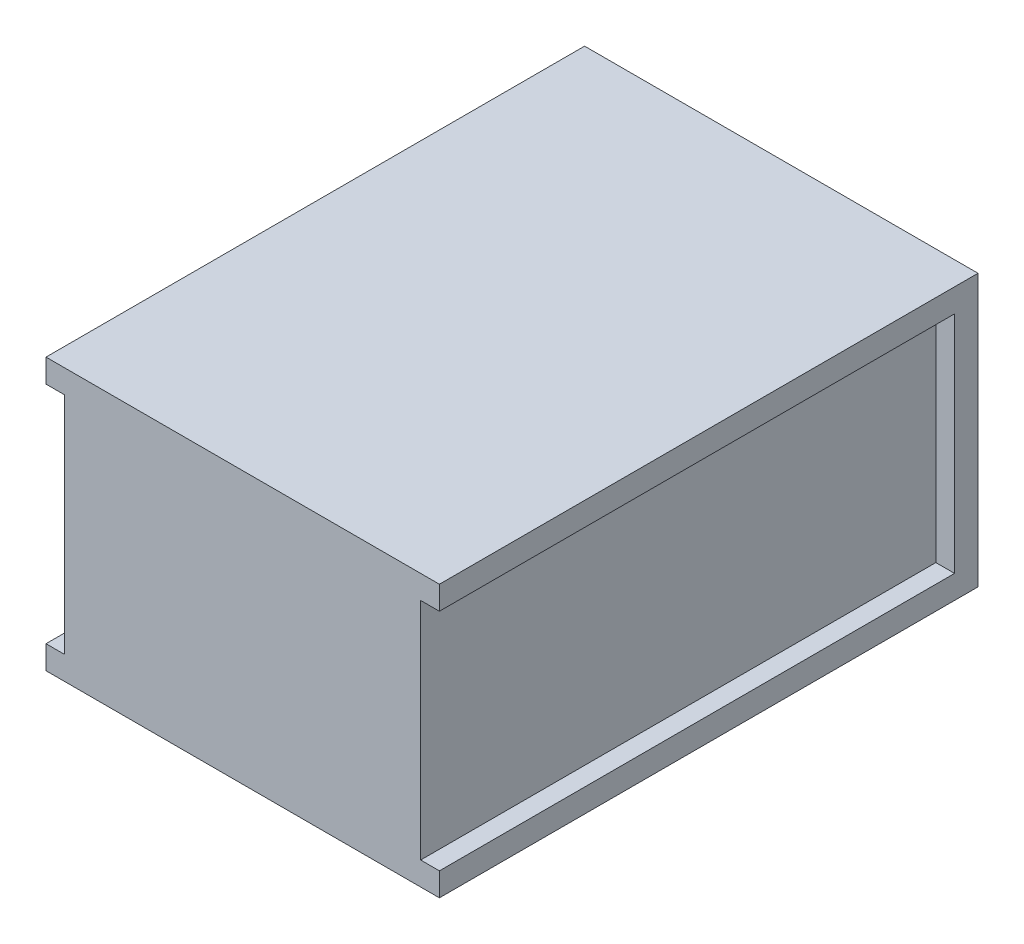
ISO-10303-21;
HEADER;
FILE_DESCRIPTION(('STEP AP214'),'2;1');
FILE_NAME('part.step','',(''),(''),'','','');
FILE_SCHEMA(('AUTOMOTIVE_DESIGN { 1 0 10303 214 1 1 1 1 }'));
ENDSEC;
DATA;
#1=APPLICATION_CONTEXT('core data for automotive mechanical design processes');
#2=APPLICATION_PROTOCOL_DEFINITION('international standard','automotive_design',2000,#1);
#3=PRODUCT_CONTEXT('',#1,'mechanical');
#4=PRODUCT('Part','Part','',(#3));
#5=PRODUCT_RELATED_PRODUCT_CATEGORY('part','',(#4));
#6=PRODUCT_DEFINITION_FORMATION('','',#4);
#7=PRODUCT_DEFINITION_CONTEXT('part definition',#1,'design');
#8=PRODUCT_DEFINITION('design','',#6,#7);
#9=PRODUCT_DEFINITION_SHAPE('','',#8);
#10=(LENGTH_UNIT() NAMED_UNIT(*) SI_UNIT(.MILLI.,.METRE.));
#11=(NAMED_UNIT(*) PLANE_ANGLE_UNIT() SI_UNIT($,.RADIAN.));
#12=(NAMED_UNIT(*) SI_UNIT($,.STERADIAN.) SOLID_ANGLE_UNIT());
#13=UNCERTAINTY_MEASURE_WITH_UNIT(LENGTH_MEASURE(1.E-05),#10,'distance_accuracy_value','');
#14=(GEOMETRIC_REPRESENTATION_CONTEXT(3) GLOBAL_UNCERTAINTY_ASSIGNED_CONTEXT((#13)) GLOBAL_UNIT_ASSIGNED_CONTEXT((#10,
#11,#12)) REPRESENTATION_CONTEXT('',''));
#15=CARTESIAN_POINT('',(0.,0.,0.));
#16=DIRECTION('',(0.,0.,1.));
#17=DIRECTION('',(1.,0.,0.));
#18=AXIS2_PLACEMENT_3D('',#15,#16,#17);
#19=CARTESIAN_POINT('',(-42.,58.,57.5));
#20=DIRECTION('',(0.,0.,-1.));
#21=DIRECTION('',(-1.,0.,0.));
#22=AXIS2_PLACEMENT_3D('',#19,#20,#21);
#23=PLANE('',#22);
#24=DIRECTION('',(1.,0.,0.));
#25=VECTOR('',#24,1.);
#26=CARTESIAN_POINT('',(38.,53.,57.5));
#27=LINE('',#26,#25);
#28=CARTESIAN_POINT('',(38.,53.,57.5));
#29=VERTEX_POINT('',#28);
#30=CARTESIAN_POINT('',(42.,53.,57.5));
#31=VERTEX_POINT('',#30);
#32=EDGE_CURVE('E167',#29,#31,#27,.T.);
#33=ORIENTED_EDGE('',*,*,#32,.T.);
#34=DIRECTION('',(0.,-1.,0.));
#35=VECTOR('',#34,1.);
#36=CARTESIAN_POINT('',(42.,58.,57.5));
#37=LINE('',#36,#35);
#38=CARTESIAN_POINT('',(42.,58.,57.5));
#39=VERTEX_POINT('',#38);
#40=EDGE_CURVE('E202',#39,#31,#37,.T.);
#41=ORIENTED_EDGE('',*,*,#40,.F.);
#42=DIRECTION('',(1.,0.,0.));
#43=VECTOR('',#42,1.);
#44=CARTESIAN_POINT('',(-42.,58.,57.5));
#45=LINE('',#44,#43);
#46=CARTESIAN_POINT('',(-42.,58.,57.5));
#47=VERTEX_POINT('',#46);
#48=EDGE_CURVE('E183',#47,#39,#45,.T.);
#49=ORIENTED_EDGE('',*,*,#48,.F.);
#50=DIRECTION('',(0.,-1.,0.));
#51=VECTOR('',#50,1.);
#52=CARTESIAN_POINT('',(-42.,58.,57.5));
#53=LINE('',#52,#51);
#54=CARTESIAN_POINT('',(-42.,53.,57.5));
#55=VERTEX_POINT('',#54);
#56=EDGE_CURVE('E11',#47,#55,#53,.T.);
#57=ORIENTED_EDGE('',*,*,#56,.T.);
#58=DIRECTION('',(-1.,0.,0.));
#59=VECTOR('',#58,1.);
#60=CARTESIAN_POINT('',(-38.,53.,57.5));
#61=LINE('',#60,#59);
#62=CARTESIAN_POINT('',(-38.,53.,57.5));
#63=VERTEX_POINT('',#62);
#64=EDGE_CURVE('E162',#63,#55,#61,.T.);
#65=ORIENTED_EDGE('',*,*,#64,.F.);
#66=DIRECTION('',(0.,1.,0.));
#67=VECTOR('',#66,1.);
#68=CARTESIAN_POINT('',(-38.,53.,57.5));
#69=LINE('',#68,#67);
#70=CARTESIAN_POINT('',(-38.,4.99999999999999,57.5));
#71=VERTEX_POINT('',#70);
#72=EDGE_CURVE('E153',#71,#63,#69,.T.);
#73=ORIENTED_EDGE('',*,*,#72,.F.);
#74=DIRECTION('',(-1.,0.,0.));
#75=VECTOR('',#74,1.);
#76=CARTESIAN_POINT('',(-38.,5.,57.5));
#77=LINE('',#76,#75);
#78=CARTESIAN_POINT('',(-42.,5.,57.5));
#79=VERTEX_POINT('',#78);
#80=EDGE_CURVE('E171',#71,#79,#77,.T.);
#81=ORIENTED_EDGE('',*,*,#80,.T.);
#82=CARTESIAN_POINT('',(-42.,0.,57.5));
#83=VERTEX_POINT('',#82);
#84=EDGE_CURVE('E44',#79,#83,#53,.T.);
#85=ORIENTED_EDGE('',*,*,#84,.T.);
#86=DIRECTION('',(1.,0.,0.));
#87=VECTOR('',#86,1.);
#88=CARTESIAN_POINT('',(-42.,0.,57.5));
#89=LINE('',#88,#87);
#90=CARTESIAN_POINT('',(42.,0.,57.5));
#91=VERTEX_POINT('',#90);
#92=EDGE_CURVE('E193',#83,#91,#89,.T.);
#93=ORIENTED_EDGE('',*,*,#92,.T.);
#94=CARTESIAN_POINT('',(42.,5.00000000000001,57.5));
#95=VERTEX_POINT('',#94);
#96=EDGE_CURVE('E146',#95,#91,#37,.T.);
#97=ORIENTED_EDGE('',*,*,#96,.F.);
#98=DIRECTION('',(1.,0.,0.));
#99=VECTOR('',#98,1.);
#100=CARTESIAN_POINT('',(38.,5.,57.5));
#101=LINE('',#100,#99);
#102=CARTESIAN_POINT('',(38.,5.,57.5));
#103=VERTEX_POINT('',#102);
#104=EDGE_CURVE('E51',#103,#95,#101,.T.);
#105=ORIENTED_EDGE('',*,*,#104,.F.);
#106=DIRECTION('',(0.,1.,0.));
#107=VECTOR('',#106,1.);
#108=CARTESIAN_POINT('',(38.,53.,57.5));
#109=LINE('',#108,#107);
#110=EDGE_CURVE('E134',#103,#29,#109,.T.);
#111=ORIENTED_EDGE('',*,*,#110,.T.);
#112=EDGE_LOOP('',(#33,#41,#49,#57,#65,#73,#81,#85,#93,#97,#105,#111));
#113=FACE_BOUND('',#112,.T.);
#114=ADVANCED_FACE('F36',(#113),#23,.F.);
#115=CARTESIAN_POINT('',(42.,58.,-57.5));
#116=DIRECTION('',(-1.,0.,0.));
#117=DIRECTION('',(0.,0.,1.));
#118=AXIS2_PLACEMENT_3D('',#115,#116,#117);
#119=PLANE('',#118);
#120=DIRECTION('',(0.,0.,-1.));
#121=VECTOR('',#120,1.);
#122=CARTESIAN_POINT('',(42.,53.,57.5));
#123=LINE('',#122,#121);
#124=CARTESIAN_POINT('',(42.,53.,-52.5));
#125=VERTEX_POINT('',#124);
#126=EDGE_CURVE('E142',#31,#125,#123,.T.);
#127=ORIENTED_EDGE('',*,*,#126,.T.);
#128=DIRECTION('',(0.,-1.,0.));
#129=VECTOR('',#128,1.);
#130=CARTESIAN_POINT('',(42.,53.,-52.5));
#131=LINE('',#130,#129);
#132=CARTESIAN_POINT('',(42.,4.99999999999999,-52.5));
#133=VERTEX_POINT('',#132);
#134=EDGE_CURVE('E233',#125,#133,#131,.T.);
#135=ORIENTED_EDGE('',*,*,#134,.T.);
#136=DIRECTION('',(0.,0.,1.));
#137=VECTOR('',#136,1.);
#138=CARTESIAN_POINT('',(42.,5.,57.5));
#139=LINE('',#138,#137);
#140=EDGE_CURVE('E212',#133,#95,#139,.T.);
#141=ORIENTED_EDGE('',*,*,#140,.T.);
#142=ORIENTED_EDGE('',*,*,#96,.T.);
#143=DIRECTION('',(0.,0.,-1.));
#144=VECTOR('',#143,1.);
#145=CARTESIAN_POINT('',(42.,0.,-57.5));
#146=LINE('',#145,#144);
#147=CARTESIAN_POINT('',(42.,0.,-57.5));
#148=VERTEX_POINT('',#147);
#149=EDGE_CURVE('E195',#91,#148,#146,.T.);
#150=ORIENTED_EDGE('',*,*,#149,.T.);
#151=DIRECTION('',(0.,-1.,0.));
#152=VECTOR('',#151,1.);
#153=CARTESIAN_POINT('',(42.,58.,-57.5));
#154=LINE('',#153,#152);
#155=CARTESIAN_POINT('',(42.,58.,-57.5));
#156=VERTEX_POINT('',#155);
#157=EDGE_CURVE('E200',#156,#148,#154,.T.);
#158=ORIENTED_EDGE('',*,*,#157,.F.);
#159=DIRECTION('',(0.,0.,-1.));
#160=VECTOR('',#159,1.);
#161=CARTESIAN_POINT('',(42.,58.,-57.5));
#162=LINE('',#161,#160);
#163=EDGE_CURVE('E186',#39,#156,#162,.T.);
#164=ORIENTED_EDGE('',*,*,#163,.F.);
#165=ORIENTED_EDGE('',*,*,#40,.T.);
#166=EDGE_LOOP('',(#127,#135,#141,#142,#150,#158,#164,#165));
#167=FACE_BOUND('',#166,.T.);
#168=ADVANCED_FACE('F208',(#167),#119,.F.);
#169=CARTESIAN_POINT('',(-42.,58.,-57.5));
#170=DIRECTION('',(1.,0.,0.));
#171=DIRECTION('',(0.,0.,-1.));
#172=AXIS2_PLACEMENT_3D('',#169,#170,#171);
#173=PLANE('',#172);
#174=ORIENTED_EDGE('',*,*,#84,.F.);
#175=DIRECTION('',(0.,0.,1.));
#176=VECTOR('',#175,1.);
#177=CARTESIAN_POINT('',(-42.,5.,57.5));
#178=LINE('',#177,#176);
#179=CARTESIAN_POINT('',(-42.,4.99999999999999,-52.5));
#180=VERTEX_POINT('',#179);
#181=EDGE_CURVE('E156',#180,#79,#178,.T.);
#182=ORIENTED_EDGE('',*,*,#181,.F.);
#183=DIRECTION('',(0.,-1.,0.));
#184=VECTOR('',#183,1.);
#185=CARTESIAN_POINT('',(-42.,53.,-52.5));
#186=LINE('',#185,#184);
#187=CARTESIAN_POINT('',(-42.,53.,-52.5));
#188=VERTEX_POINT('',#187);
#189=EDGE_CURVE('E166',#188,#180,#186,.T.);
#190=ORIENTED_EDGE('',*,*,#189,.F.);
#191=DIRECTION('',(0.,0.,-1.));
#192=VECTOR('',#191,1.);
#193=CARTESIAN_POINT('',(-42.,53.,57.5));
#194=LINE('',#193,#192);
#195=EDGE_CURVE('E163',#55,#188,#194,.T.);
#196=ORIENTED_EDGE('',*,*,#195,.F.);
#197=ORIENTED_EDGE('',*,*,#56,.F.);
#198=DIRECTION('',(0.,0.,1.));
#199=VECTOR('',#198,1.);
#200=CARTESIAN_POINT('',(-42.,58.,-57.5));
#201=LINE('',#200,#199);
#202=CARTESIAN_POINT('',(-42.,58.,-57.5));
#203=VERTEX_POINT('',#202);
#204=EDGE_CURVE('E180',#203,#47,#201,.T.);
#205=ORIENTED_EDGE('',*,*,#204,.F.);
#206=DIRECTION('',(0.,-1.,0.));
#207=VECTOR('',#206,1.);
#208=CARTESIAN_POINT('',(-42.,58.,-57.5));
#209=LINE('',#208,#207);
#210=CARTESIAN_POINT('',(-42.,0.,-57.5));
#211=VERTEX_POINT('',#210);
#212=EDGE_CURVE('E190',#203,#211,#209,.T.);
#213=ORIENTED_EDGE('',*,*,#212,.T.);
#214=DIRECTION('',(0.,0.,1.));
#215=VECTOR('',#214,1.);
#216=CARTESIAN_POINT('',(-42.,0.,-57.5));
#217=LINE('',#216,#215);
#218=EDGE_CURVE('E174',#211,#83,#217,.T.);
#219=ORIENTED_EDGE('',*,*,#218,.T.);
#220=EDGE_LOOP('',(#174,#182,#190,#196,#197,#205,#213,#219));
#221=FACE_BOUND('',#220,.T.);
#222=ADVANCED_FACE('F38',(#221),#173,.F.);
#223=CARTESIAN_POINT('',(-42.,58.,-57.5));
#224=DIRECTION('',(0.,0.,1.));
#225=DIRECTION('',(1.,0.,0.));
#226=AXIS2_PLACEMENT_3D('',#223,#224,#225);
#227=PLANE('',#226);
#228=DIRECTION('',(-1.,0.,0.));
#229=VECTOR('',#228,1.);
#230=CARTESIAN_POINT('',(-42.,0.,-57.5));
#231=LINE('',#230,#229);
#232=EDGE_CURVE('E184',#148,#211,#231,.T.);
#233=ORIENTED_EDGE('',*,*,#232,.T.);
#234=ORIENTED_EDGE('',*,*,#212,.F.);
#235=DIRECTION('',(-1.,0.,0.));
#236=VECTOR('',#235,1.);
#237=CARTESIAN_POINT('',(-42.,58.,-57.5));
#238=LINE('',#237,#236);
#239=EDGE_CURVE('E188',#156,#203,#238,.T.);
#240=ORIENTED_EDGE('',*,*,#239,.F.);
#241=ORIENTED_EDGE('',*,*,#157,.T.);
#242=EDGE_LOOP('',(#233,#234,#240,#241));
#243=FACE_BOUND('',#242,.T.);
#244=ADVANCED_FACE('F221',(#243),#227,.F.);
#245=CARTESIAN_POINT('',(0.,58.,0.));
#246=DIRECTION('',(0.,1.,0.));
#247=DIRECTION('',(0.,0.,1.));
#248=AXIS2_PLACEMENT_3D('',#245,#246,#247);
#249=PLANE('',#248);
#250=ORIENTED_EDGE('',*,*,#204,.T.);
#251=ORIENTED_EDGE('',*,*,#48,.T.);
#252=ORIENTED_EDGE('',*,*,#163,.T.);
#253=ORIENTED_EDGE('',*,*,#239,.T.);
#254=EDGE_LOOP('',(#250,#251,#252,#253));
#255=FACE_BOUND('',#254,.T.);
#256=ADVANCED_FACE('F228',(#255),#249,.T.);
#257=CARTESIAN_POINT('',(0.,0.,0.));
#258=DIRECTION('',(0.,1.,0.));
#259=DIRECTION('',(0.,0.,1.));
#260=AXIS2_PLACEMENT_3D('',#257,#258,#259);
#261=PLANE('',#260);
#262=ORIENTED_EDGE('',*,*,#218,.F.);
#263=ORIENTED_EDGE('',*,*,#232,.F.);
#264=ORIENTED_EDGE('',*,*,#149,.F.);
#265=ORIENTED_EDGE('',*,*,#92,.F.);
#266=EDGE_LOOP('',(#262,#263,#264,#265));
#267=FACE_BOUND('',#266,.T.);
#268=ADVANCED_FACE('F218',(#267),#261,.F.);
#269=CARTESIAN_POINT('',(-38.,5.,57.5));
#270=DIRECTION('',(0.,-1.,0.));
#271=DIRECTION('',(0.,0.,-1.));
#272=AXIS2_PLACEMENT_3D('',#269,#270,#271);
#273=PLANE('',#272);
#274=ORIENTED_EDGE('',*,*,#181,.T.);
#275=ORIENTED_EDGE('',*,*,#80,.F.);
#276=DIRECTION('',(0.,0.,1.));
#277=VECTOR('',#276,1.);
#278=CARTESIAN_POINT('',(-38.,5.,57.5));
#279=LINE('',#278,#277);
#280=CARTESIAN_POINT('',(-38.,4.99999999999999,-52.5));
#281=VERTEX_POINT('',#280);
#282=EDGE_CURVE('E59',#281,#71,#279,.T.);
#283=ORIENTED_EDGE('',*,*,#282,.F.);
#284=DIRECTION('',(-1.,0.,0.));
#285=VECTOR('',#284,1.);
#286=CARTESIAN_POINT('',(-38.,4.99999999999999,-52.5));
#287=LINE('',#286,#285);
#288=EDGE_CURVE('E175',#281,#180,#287,.T.);
#289=ORIENTED_EDGE('',*,*,#288,.T.);
#290=EDGE_LOOP('',(#274,#275,#283,#289));
#291=FACE_BOUND('',#290,.T.);
#292=ADVANCED_FACE('F262',(#291),#273,.F.);
#293=CARTESIAN_POINT('',(-38.,53.,-52.5));
#294=DIRECTION('',(0.,0.,-1.));
#295=DIRECTION('',(0.,1.,0.));
#296=AXIS2_PLACEMENT_3D('',#293,#294,#295);
#297=PLANE('',#296);
#298=ORIENTED_EDGE('',*,*,#189,.T.);
#299=ORIENTED_EDGE('',*,*,#288,.F.);
#300=DIRECTION('',(0.,-1.,0.));
#301=VECTOR('',#300,1.);
#302=CARTESIAN_POINT('',(-38.,53.,-52.5));
#303=LINE('',#302,#301);
#304=CARTESIAN_POINT('',(-38.,53.,-52.5));
#305=VERTEX_POINT('',#304);
#306=EDGE_CURVE('E159',#305,#281,#303,.T.);
#307=ORIENTED_EDGE('',*,*,#306,.F.);
#308=DIRECTION('',(-1.,0.,0.));
#309=VECTOR('',#308,1.);
#310=CARTESIAN_POINT('',(-38.,53.,-52.5));
#311=LINE('',#310,#309);
#312=EDGE_CURVE('E177',#305,#188,#311,.T.);
#313=ORIENTED_EDGE('',*,*,#312,.T.);
#314=EDGE_LOOP('',(#298,#299,#307,#313));
#315=FACE_BOUND('',#314,.T.);
#316=ADVANCED_FACE('F267',(#315),#297,.F.);
#317=CARTESIAN_POINT('',(-38.,53.,57.5));
#318=DIRECTION('',(0.,1.,0.));
#319=DIRECTION('',(0.,0.,1.));
#320=AXIS2_PLACEMENT_3D('',#317,#318,#319);
#321=PLANE('',#320);
#322=ORIENTED_EDGE('',*,*,#195,.T.);
#323=ORIENTED_EDGE('',*,*,#312,.F.);
#324=DIRECTION('',(0.,0.,-1.));
#325=VECTOR('',#324,1.);
#326=CARTESIAN_POINT('',(-38.,53.,57.5));
#327=LINE('',#326,#325);
#328=EDGE_CURVE('E155',#63,#305,#327,.T.);
#329=ORIENTED_EDGE('',*,*,#328,.F.);
#330=ORIENTED_EDGE('',*,*,#64,.T.);
#331=EDGE_LOOP('',(#322,#323,#329,#330));
#332=FACE_BOUND('',#331,.T.);
#333=ADVANCED_FACE('F249',(#332),#321,.F.);
#334=CARTESIAN_POINT('',(-38.,0.,0.));
#335=DIRECTION('',(1.,0.,0.));
#336=DIRECTION('',(0.,0.,-1.));
#337=AXIS2_PLACEMENT_3D('',#334,#335,#336);
#338=PLANE('',#337);
#339=ORIENTED_EDGE('',*,*,#72,.T.);
#340=ORIENTED_EDGE('',*,*,#328,.T.);
#341=ORIENTED_EDGE('',*,*,#306,.T.);
#342=ORIENTED_EDGE('',*,*,#282,.T.);
#343=EDGE_LOOP('',(#339,#340,#341,#342));
#344=FACE_BOUND('',#343,.T.);
#345=ADVANCED_FACE('F242',(#344),#338,.F.);
#346=CARTESIAN_POINT('',(38.,53.,57.5));
#347=DIRECTION('',(0.,-1.,0.));
#348=DIRECTION('',(0.,0.,-1.));
#349=AXIS2_PLACEMENT_3D('',#346,#347,#348);
#350=PLANE('',#349);
#351=ORIENTED_EDGE('',*,*,#126,.F.);
#352=ORIENTED_EDGE('',*,*,#32,.F.);
#353=DIRECTION('',(0.,0.,-1.));
#354=VECTOR('',#353,1.);
#355=CARTESIAN_POINT('',(38.,53.,57.5));
#356=LINE('',#355,#354);
#357=CARTESIAN_POINT('',(38.,53.,-52.5));
#358=VERTEX_POINT('',#357);
#359=EDGE_CURVE('E138',#29,#358,#356,.T.);
#360=ORIENTED_EDGE('',*,*,#359,.T.);
#361=DIRECTION('',(1.,0.,0.));
#362=VECTOR('',#361,1.);
#363=CARTESIAN_POINT('',(38.,53.,-52.5));
#364=LINE('',#363,#362);
#365=EDGE_CURVE('E148',#358,#125,#364,.T.);
#366=ORIENTED_EDGE('',*,*,#365,.T.);
#367=EDGE_LOOP('',(#351,#352,#360,#366));
#368=FACE_BOUND('',#367,.T.);
#369=ADVANCED_FACE('F240',(#368),#350,.T.);
#370=CARTESIAN_POINT('',(38.,53.,-52.5));
#371=DIRECTION('',(0.,0.,1.));
#372=DIRECTION('',(0.,-1.,0.));
#373=AXIS2_PLACEMENT_3D('',#370,#371,#372);
#374=PLANE('',#373);
#375=ORIENTED_EDGE('',*,*,#134,.F.);
#376=ORIENTED_EDGE('',*,*,#365,.F.);
#377=DIRECTION('',(0.,-1.,0.));
#378=VECTOR('',#377,1.);
#379=CARTESIAN_POINT('',(38.,53.,-52.5));
#380=LINE('',#379,#378);
#381=CARTESIAN_POINT('',(38.,4.99999999999999,-52.5));
#382=VERTEX_POINT('',#381);
#383=EDGE_CURVE('E133',#358,#382,#380,.T.);
#384=ORIENTED_EDGE('',*,*,#383,.T.);
#385=DIRECTION('',(1.,0.,0.));
#386=VECTOR('',#385,1.);
#387=CARTESIAN_POINT('',(38.,4.99999999999999,-52.5));
#388=LINE('',#387,#386);
#389=EDGE_CURVE('E130',#382,#133,#388,.T.);
#390=ORIENTED_EDGE('',*,*,#389,.T.);
#391=EDGE_LOOP('',(#375,#376,#384,#390));
#392=FACE_BOUND('',#391,.T.);
#393=ADVANCED_FACE('F239',(#392),#374,.T.);
#394=CARTESIAN_POINT('',(38.,5.,57.5));
#395=DIRECTION('',(0.,1.,0.));
#396=DIRECTION('',(0.,0.,1.));
#397=AXIS2_PLACEMENT_3D('',#394,#395,#396);
#398=PLANE('',#397);
#399=ORIENTED_EDGE('',*,*,#140,.F.);
#400=ORIENTED_EDGE('',*,*,#389,.F.);
#401=DIRECTION('',(0.,0.,1.));
#402=VECTOR('',#401,1.);
#403=CARTESIAN_POINT('',(38.,5.,57.5));
#404=LINE('',#403,#402);
#405=EDGE_CURVE('E127',#382,#103,#404,.T.);
#406=ORIENTED_EDGE('',*,*,#405,.T.);
#407=ORIENTED_EDGE('',*,*,#104,.T.);
#408=EDGE_LOOP('',(#399,#400,#406,#407));
#409=FACE_BOUND('',#408,.T.);
#410=ADVANCED_FACE('F129',(#409),#398,.T.);
#411=CARTESIAN_POINT('',(38.,0.,0.));
#412=DIRECTION('',(-1.,0.,0.));
#413=DIRECTION('',(0.,0.,-1.));
#414=AXIS2_PLACEMENT_3D('',#411,#412,#413);
#415=PLANE('',#414);
#416=ORIENTED_EDGE('',*,*,#110,.F.);
#417=ORIENTED_EDGE('',*,*,#405,.F.);
#418=ORIENTED_EDGE('',*,*,#383,.F.);
#419=ORIENTED_EDGE('',*,*,#359,.F.);
#420=EDGE_LOOP('',(#416,#417,#418,#419));
#421=FACE_BOUND('',#420,.T.);
#422=ADVANCED_FACE('F137',(#421),#415,.F.);
#423=CLOSED_SHELL('',(#114,#168,#222,#244,#256,#268,#292,#316,#333,#345,#369,#393,#410,#422));
#424=MANIFOLD_SOLID_BREP('B2',#423);
#425=ADVANCED_BREP_SHAPE_REPRESENTATION('',(#18,#424),#14);
#426=SHAPE_DEFINITION_REPRESENTATION(#9,#425);
ENDSEC;
END-ISO-10303-21;
